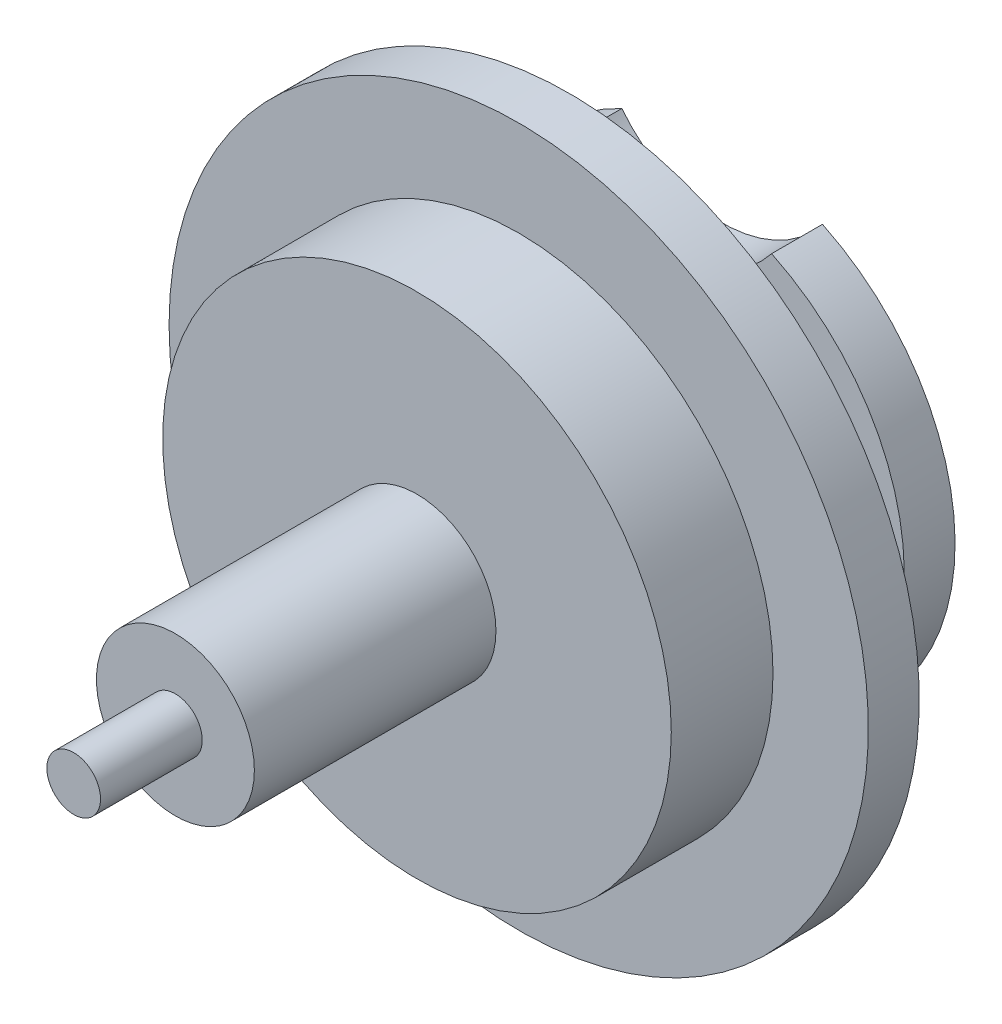
ISO-10303-21;
HEADER;
FILE_DESCRIPTION(('STEP AP214'),'2;1');
FILE_NAME('part.step','',(''),(''),'','','');
FILE_SCHEMA(('AUTOMOTIVE_DESIGN { 1 0 10303 214 1 1 1 1 }'));
ENDSEC;
DATA;
#1=APPLICATION_CONTEXT('core data for automotive mechanical design processes');
#2=APPLICATION_PROTOCOL_DEFINITION('international standard','automotive_design',2000,#1);
#3=PRODUCT_CONTEXT('',#1,'mechanical');
#4=PRODUCT('Part','Part','',(#3));
#5=PRODUCT_RELATED_PRODUCT_CATEGORY('part','',(#4));
#6=PRODUCT_DEFINITION_FORMATION('','',#4);
#7=PRODUCT_DEFINITION_CONTEXT('part definition',#1,'design');
#8=PRODUCT_DEFINITION('design','',#6,#7);
#9=PRODUCT_DEFINITION_SHAPE('','',#8);
#10=(LENGTH_UNIT() NAMED_UNIT(*) SI_UNIT(.MILLI.,.METRE.));
#11=(NAMED_UNIT(*) PLANE_ANGLE_UNIT() SI_UNIT($,.RADIAN.));
#12=(NAMED_UNIT(*) SI_UNIT($,.STERADIAN.) SOLID_ANGLE_UNIT());
#13=UNCERTAINTY_MEASURE_WITH_UNIT(LENGTH_MEASURE(1.E-05),#10,'distance_accuracy_value','');
#14=(GEOMETRIC_REPRESENTATION_CONTEXT(3) GLOBAL_UNCERTAINTY_ASSIGNED_CONTEXT((#13)) GLOBAL_UNIT_ASSIGNED_CONTEXT((#10,
#11,#12)) REPRESENTATION_CONTEXT('',''));
#15=CARTESIAN_POINT('',(0.,0.,0.));
#16=DIRECTION('',(0.,0.,1.));
#17=DIRECTION('',(1.,0.,0.));
#18=AXIS2_PLACEMENT_3D('',#15,#16,#17);
#19=CARTESIAN_POINT('',(0.,0.,-0.4));
#20=DIRECTION('',(0.,0.,1.));
#21=DIRECTION('',(1.,0.,0.));
#22=AXIS2_PLACEMENT_3D('',#19,#20,#21);
#23=CYLINDRICAL_SURFACE('',#22,1.);
#24=CARTESIAN_POINT('',(0.,0.,-0.4));
#25=DIRECTION('',(0.,0.,-1.));
#26=DIRECTION('',(-1.,0.,0.));
#27=AXIS2_PLACEMENT_3D('',#24,#25,#26);
#28=CIRCLE('',#27,1.);
#29=CARTESIAN_POINT('',(-1.,0.,-0.4));
#30=VERTEX_POINT('',#29);
#31=EDGE_CURVE('E86',#30,#30,#28,.F.);
#32=ORIENTED_EDGE('',*,*,#31,.T.);
#33=EDGE_LOOP('',(#32));
#34=FACE_BOUND('',#33,.T.);
#35=CARTESIAN_POINT('',(0.,0.,0.));
#36=DIRECTION('',(0.,0.,1.));
#37=DIRECTION('',(1.,0.,0.));
#38=AXIS2_PLACEMENT_3D('',#35,#36,#37);
#39=CIRCLE('',#38,1.);
#40=CARTESIAN_POINT('',(1.,0.,0.));
#41=VERTEX_POINT('',#40);
#42=EDGE_CURVE('E93',#41,#41,#39,.T.);
#43=ORIENTED_EDGE('',*,*,#42,.F.);
#44=EDGE_LOOP('',(#43));
#45=FACE_BOUND('',#44,.T.);
#46=ADVANCED_FACE('F37',(#34,#45),#23,.T.);
#47=CARTESIAN_POINT('',(0.,0.,0.));
#48=DIRECTION('',(0.,0.,1.));
#49=DIRECTION('',(1.,0.,0.));
#50=AXIS2_PLACEMENT_3D('',#47,#48,#49);
#51=PLANE('',#50);
#52=CARTESIAN_POINT('',(0.,0.,0.));
#53=DIRECTION('',(0.,0.,1.));
#54=DIRECTION('',(1.,0.,0.));
#55=AXIS2_PLACEMENT_3D('',#52,#53,#54);
#56=CIRCLE('',#55,0.3105);
#57=CARTESIAN_POINT('',(0.3105,0.,0.));
#58=VERTEX_POINT('',#57);
#59=EDGE_CURVE('E96',#58,#58,#56,.T.);
#60=ORIENTED_EDGE('',*,*,#59,.F.);
#61=EDGE_LOOP('',(#60));
#62=FACE_BOUND('',#61,.T.);
#63=ORIENTED_EDGE('',*,*,#42,.T.);
#64=EDGE_LOOP('',(#63));
#65=FACE_BOUND('',#64,.T.);
#66=ADVANCED_FACE('F137',(#62,#65),#51,.T.);
#67=CARTESIAN_POINT('',(0.,0.,1.35));
#68=DIRECTION('',(0.,0.,1.));
#69=DIRECTION('',(1.,0.,0.));
#70=AXIS2_PLACEMENT_3D('',#67,#68,#69);
#71=PLANE('',#70);
#72=CARTESIAN_POINT('',(0.,0.,1.35));
#73=DIRECTION('',(0.,0.,1.));
#74=DIRECTION('',(1.,0.,0.));
#75=AXIS2_PLACEMENT_3D('',#72,#73,#74);
#76=CIRCLE('',#75,0.1055);
#77=CARTESIAN_POINT('',(0.1055,0.,1.35));
#78=VERTEX_POINT('',#77);
#79=EDGE_CURVE('E101',#78,#78,#76,.T.);
#80=ORIENTED_EDGE('',*,*,#79,.T.);
#81=EDGE_LOOP('',(#80));
#82=FACE_BOUND('',#81,.T.);
#83=ADVANCED_FACE('F143',(#82),#71,.T.);
#84=CARTESIAN_POINT('',(0.,0.,2.04839906166072));
#85=DIRECTION('',(0.,0.,-1.));
#86=DIRECTION('',(-1.,0.,0.));
#87=AXIS2_PLACEMENT_3D('',#84,#85,#86);
#88=CYLINDRICAL_SURFACE('',#87,0.1055);
#89=CARTESIAN_POINT('',(0.,0.,0.95));
#90=DIRECTION('',(0.,0.,1.));
#91=DIRECTION('',(1.,0.,0.));
#92=AXIS2_PLACEMENT_3D('',#89,#90,#91);
#93=CIRCLE('',#92,0.1055);
#94=CARTESIAN_POINT('',(0.1055,0.,0.95));
#95=VERTEX_POINT('',#94);
#96=EDGE_CURVE('E104',#95,#95,#93,.F.);
#97=ORIENTED_EDGE('',*,*,#96,.F.);
#98=EDGE_LOOP('',(#97));
#99=FACE_BOUND('',#98,.T.);
#100=ORIENTED_EDGE('',*,*,#79,.F.);
#101=EDGE_LOOP('',(#100));
#102=FACE_BOUND('',#101,.T.);
#103=ADVANCED_FACE('F153',(#99,#102),#88,.T.);
#104=CARTESIAN_POINT('',(0.,0.,0.95));
#105=DIRECTION('',(0.,0.,1.));
#106=DIRECTION('',(1.,0.,0.));
#107=AXIS2_PLACEMENT_3D('',#104,#105,#106);
#108=PLANE('',#107);
#109=ORIENTED_EDGE('',*,*,#96,.T.);
#110=EDGE_LOOP('',(#109));
#111=FACE_BOUND('',#110,.T.);
#112=CARTESIAN_POINT('',(0.,0.,0.95));
#113=DIRECTION('',(0.,0.,1.));
#114=DIRECTION('',(1.,0.,0.));
#115=AXIS2_PLACEMENT_3D('',#112,#113,#114);
#116=CIRCLE('',#115,0.3105);
#117=CARTESIAN_POINT('',(0.3105,0.,0.95));
#118=VERTEX_POINT('',#117);
#119=EDGE_CURVE('E45',#118,#118,#116,.T.);
#120=ORIENTED_EDGE('',*,*,#119,.T.);
#121=EDGE_LOOP('',(#120));
#122=FACE_BOUND('',#121,.T.);
#123=ADVANCED_FACE('F156',(#111,#122),#108,.T.);
#124=CARTESIAN_POINT('',(0.,0.,0.95));
#125=DIRECTION('',(0.,0.,-1.));
#126=DIRECTION('',(-1.,0.,0.));
#127=AXIS2_PLACEMENT_3D('',#124,#125,#126);
#128=CYLINDRICAL_SURFACE('',#127,0.3105);
#129=ORIENTED_EDGE('',*,*,#59,.T.);
#130=EDGE_LOOP('',(#129));
#131=FACE_BOUND('',#130,.T.);
#132=ORIENTED_EDGE('',*,*,#119,.F.);
#133=EDGE_LOOP('',(#132));
#134=FACE_BOUND('',#133,.T.);
#135=ADVANCED_FACE('F39',(#131,#134),#128,.T.);
#136=CARTESIAN_POINT('',(0.,0.,-0.6));
#137=DIRECTION('',(0.,0.,1.));
#138=DIRECTION('',(1.,0.,0.));
#139=AXIS2_PLACEMENT_3D('',#136,#137,#138);
#140=CYLINDRICAL_SURFACE('',#139,1.375);
#141=CARTESIAN_POINT('',(0.,0.,-0.6));
#142=DIRECTION('',(0.,0.,-1.));
#143=DIRECTION('',(-1.,0.,0.));
#144=AXIS2_PLACEMENT_3D('',#141,#142,#143);
#145=CIRCLE('',#144,1.375);
#146=CARTESIAN_POINT('',(-1.375,0.,-0.6));
#147=VERTEX_POINT('',#146);
#148=EDGE_CURVE('E83',#147,#147,#145,.T.);
#149=ORIENTED_EDGE('',*,*,#148,.F.);
#150=EDGE_LOOP('',(#149));
#151=FACE_BOUND('',#150,.T.);
#152=CARTESIAN_POINT('',(0.,0.,-0.4));
#153=DIRECTION('',(0.,0.,-1.));
#154=DIRECTION('',(-1.,0.,0.));
#155=AXIS2_PLACEMENT_3D('',#152,#153,#154);
#156=CIRCLE('',#155,1.375);
#157=CARTESIAN_POINT('',(-1.375,0.,-0.4));
#158=VERTEX_POINT('',#157);
#159=EDGE_CURVE('E87',#158,#158,#156,.T.);
#160=ORIENTED_EDGE('',*,*,#159,.T.);
#161=EDGE_LOOP('',(#160));
#162=FACE_BOUND('',#161,.T.);
#163=ADVANCED_FACE('F169',(#151,#162),#140,.T.);
#164=CARTESIAN_POINT('',(0.,0.,-0.6));
#165=DIRECTION('',(0.,0.,-1.));
#166=DIRECTION('',(-1.,0.,0.));
#167=AXIS2_PLACEMENT_3D('',#164,#165,#166);
#168=PLANE('',#167);
#169=CARTESIAN_POINT('',(0.,1.04366641613751,-0.6));
#170=DIRECTION('',(0.,0.,-1.));
#171=DIRECTION('',(-0.999999080588237,0.00135603196133339,0.));
#172=AXIS2_PLACEMENT_3D('',#169,#170,#171);
#173=ELLIPSE('',#172,0.246000000000004,0.0779999999999952);
#174=CARTESIAN_POINT('',(-0.245999773824706,1.044,-0.6));
#175=VERTEX_POINT('',#174);
#176=EDGE_CURVE('E206',#175,#175,#173,.T.);
#177=ORIENTED_EDGE('',*,*,#176,.F.);
#178=EDGE_LOOP('',(#177));
#179=FACE_BOUND('',#178,.T.);
#180=CARTESIAN_POINT('',(0.,0.,-0.6));
#181=DIRECTION('',(0.,0.,-1.));
#182=DIRECTION('',(-1.,0.,0.));
#183=AXIS2_PLACEMENT_3D('',#180,#181,#182);
#184=CIRCLE('',#183,0.3105);
#185=CARTESIAN_POINT('',(-0.3105,0.,-0.6));
#186=VERTEX_POINT('',#185);
#187=EDGE_CURVE('E92',#186,#186,#184,.T.);
#188=ORIENTED_EDGE('',*,*,#187,.F.);
#189=EDGE_LOOP('',(#188));
#190=FACE_BOUND('',#189,.T.);
#191=ORIENTED_EDGE('',*,*,#148,.T.);
#192=EDGE_LOOP('',(#191));
#193=FACE_BOUND('',#192,.T.);
#194=ADVANCED_FACE('F180',(#179,#190,#193),#168,.T.);
#195=CARTESIAN_POINT('',(0.,0.,-0.4));
#196=DIRECTION('',(0.,0.,-1.));
#197=DIRECTION('',(-1.,0.,0.));
#198=AXIS2_PLACEMENT_3D('',#195,#196,#197);
#199=PLANE('',#198);
#200=ORIENTED_EDGE('',*,*,#31,.F.);
#201=EDGE_LOOP('',(#200));
#202=FACE_BOUND('',#201,.T.);
#203=ORIENTED_EDGE('',*,*,#159,.F.);
#204=EDGE_LOOP('',(#203));
#205=FACE_BOUND('',#204,.T.);
#206=ADVANCED_FACE('F185',(#202,#205),#199,.F.);
#207=CARTESIAN_POINT('',(0.,0.,-1.));
#208=DIRECTION('',(0.,0.,1.));
#209=DIRECTION('',(1.,0.,0.));
#210=AXIS2_PLACEMENT_3D('',#207,#208,#209);
#211=CIRCLE('',#210,0.3105);
#212=CARTESIAN_POINT('',(0.3105,0.,-1.));
#213=VERTEX_POINT('',#212);
#214=EDGE_CURVE('E79',#213,#213,#211,.T.);
#215=ORIENTED_EDGE('',*,*,#214,.T.);
#216=EDGE_LOOP('',(#215));
#217=FACE_BOUND('',#216,.T.);
#218=ORIENTED_EDGE('',*,*,#187,.T.);
#219=EDGE_LOOP('',(#218));
#220=FACE_BOUND('',#219,.T.);
#221=ADVANCED_FACE('F120',(#217,#220),#128,.T.);
#222=CARTESIAN_POINT('',(0.,0.,-1.2));
#223=DIRECTION('',(0.,0.,1.));
#224=DIRECTION('',(1.,0.,0.));
#225=AXIS2_PLACEMENT_3D('',#222,#223,#224);
#226=CYLINDRICAL_SURFACE('',#225,0.916);
#227=DIRECTION('',(0.,0.,-1.));
#228=VECTOR('',#227,1.);
#229=CARTESIAN_POINT('',(-0.394438833135507,0.826724867724868,-1.1));
#230=LINE('',#229,#228);
#231=CARTESIAN_POINT('',(-0.394438833135507,0.826724867724868,-1.2));
#232=VERTEX_POINT('',#231);
#233=CARTESIAN_POINT('',(-0.394438833135507,0.826724867724868,-1.));
#234=VERTEX_POINT('',#233);
#235=EDGE_CURVE('E52',#232,#234,#230,.F.);
#236=ORIENTED_EDGE('',*,*,#235,.F.);
#237=CARTESIAN_POINT('',(0.,0.,-1.2));
#238=DIRECTION('',(0.,0.,1.));
#239=DIRECTION('',(1.,0.,0.));
#240=AXIS2_PLACEMENT_3D('',#237,#238,#239);
#241=CIRCLE('',#240,0.916);
#242=CARTESIAN_POINT('',(0.394438833135507,0.826724867724868,-1.2));
#243=VERTEX_POINT('',#242);
#244=EDGE_CURVE('E74',#232,#243,#241,.T.);
#245=ORIENTED_EDGE('',*,*,#244,.T.);
#246=DIRECTION('',(0.,0.,-1.));
#247=VECTOR('',#246,1.);
#248=CARTESIAN_POINT('',(0.394438833135507,0.826724867724868,-1.1));
#249=LINE('',#248,#247);
#250=CARTESIAN_POINT('',(0.394438833135507,0.826724867724868,-1.));
#251=VERTEX_POINT('',#250);
#252=EDGE_CURVE('E64',#251,#243,#249,.T.);
#253=ORIENTED_EDGE('',*,*,#252,.F.);
#254=CARTESIAN_POINT('',(0.,0.,-1.));
#255=DIRECTION('',(0.,0.,1.));
#256=DIRECTION('',(1.,0.,0.));
#257=AXIS2_PLACEMENT_3D('',#254,#255,#256);
#258=CIRCLE('',#257,0.916);
#259=EDGE_CURVE('E72',#234,#251,#258,.T.);
#260=ORIENTED_EDGE('',*,*,#259,.F.);
#261=EDGE_LOOP('',(#236,#245,#253,#260));
#262=FACE_BOUND('',#261,.T.);
#263=ADVANCED_FACE('F71',(#262),#226,.T.);
#264=CARTESIAN_POINT('',(0.,0.,-1.2));
#265=DIRECTION('',(0.,0.,1.));
#266=DIRECTION('',(1.,0.,0.));
#267=AXIS2_PLACEMENT_3D('',#264,#265,#266);
#268=PLANE('',#267);
#269=CARTESIAN_POINT('',(0.,0.,-1.2));
#270=DIRECTION('',(0.,0.,1.));
#271=DIRECTION('',(1.,0.,0.));
#272=AXIS2_PLACEMENT_3D('',#269,#270,#271);
#273=CIRCLE('',#272,0.3105);
#274=CARTESIAN_POINT('',(0.3105,0.,-1.2));
#275=VERTEX_POINT('',#274);
#276=EDGE_CURVE('E12',#275,#275,#273,.T.);
#277=ORIENTED_EDGE('',*,*,#276,.T.);
#278=EDGE_LOOP('',(#277));
#279=FACE_BOUND('',#278,.T.);
#280=ORIENTED_EDGE('',*,*,#244,.F.);
#281=CARTESIAN_POINT('',(0.,1.134,-1.2));
#282=DIRECTION('',(0.,0.,-1.));
#283=DIRECTION('',(-1.,0.,0.));
#284=AXIS2_PLACEMENT_3D('',#281,#282,#283);
#285=CIRCLE('',#284,0.5);
#286=EDGE_CURVE('E57',#243,#232,#285,.T.);
#287=ORIENTED_EDGE('',*,*,#286,.F.);
#288=EDGE_LOOP('',(#280,#287));
#289=FACE_BOUND('',#288,.T.);
#290=ADVANCED_FACE('F124',(#279,#289),#268,.F.);
#291=CARTESIAN_POINT('',(0.,0.,-1.));
#292=DIRECTION('',(0.,0.,1.));
#293=DIRECTION('',(1.,0.,0.));
#294=AXIS2_PLACEMENT_3D('',#291,#292,#293);
#295=PLANE('',#294);
#296=CARTESIAN_POINT('',(0.,1.134,-1.));
#297=DIRECTION('',(0.,0.,-1.));
#298=DIRECTION('',(-1.,0.,0.));
#299=AXIS2_PLACEMENT_3D('',#296,#297,#298);
#300=CIRCLE('',#299,0.5);
#301=EDGE_CURVE('E61',#251,#234,#300,.T.);
#302=ORIENTED_EDGE('',*,*,#301,.T.);
#303=ORIENTED_EDGE('',*,*,#259,.T.);
#304=EDGE_LOOP('',(#302,#303));
#305=FACE_BOUND('',#304,.T.);
#306=ORIENTED_EDGE('',*,*,#214,.F.);
#307=EDGE_LOOP('',(#306));
#308=FACE_BOUND('',#307,.T.);
#309=ADVANCED_FACE('F76',(#305,#308),#295,.T.);
#310=CARTESIAN_POINT('',(0.,0.,-1.75));
#311=DIRECTION('',(0.,0.,1.));
#312=DIRECTION('',(1.,0.,0.));
#313=AXIS2_PLACEMENT_3D('',#310,#311,#312);
#314=PLANE('',#313);
#315=CARTESIAN_POINT('',(0.,0.,-1.75));
#316=DIRECTION('',(0.,0.,1.));
#317=DIRECTION('',(1.,0.,0.));
#318=AXIS2_PLACEMENT_3D('',#315,#316,#317);
#319=CIRCLE('',#318,0.1055);
#320=CARTESIAN_POINT('',(0.1055,0.,-1.75));
#321=VERTEX_POINT('',#320);
#322=EDGE_CURVE('E97',#321,#321,#319,.F.);
#323=ORIENTED_EDGE('',*,*,#322,.T.);
#324=EDGE_LOOP('',(#323));
#325=FACE_BOUND('',#324,.T.);
#326=ADVANCED_FACE('F123',(#325),#314,.F.);
#327=CARTESIAN_POINT('',(0.,0.,-2.44839906166072));
#328=DIRECTION('',(0.,0.,1.));
#329=DIRECTION('',(1.,0.,0.));
#330=AXIS2_PLACEMENT_3D('',#327,#328,#329);
#331=CYLINDRICAL_SURFACE('',#330,0.1055);
#332=ORIENTED_EDGE('',*,*,#322,.F.);
#333=EDGE_LOOP('',(#332));
#334=FACE_BOUND('',#333,.T.);
#335=CARTESIAN_POINT('',(0.,0.,-1.35));
#336=DIRECTION('',(0.,0.,1.));
#337=DIRECTION('',(1.,0.,0.));
#338=AXIS2_PLACEMENT_3D('',#335,#336,#337);
#339=CIRCLE('',#338,0.1055);
#340=CARTESIAN_POINT('',(0.1055,0.,-1.35));
#341=VERTEX_POINT('',#340);
#342=EDGE_CURVE('E100',#341,#341,#339,.T.);
#343=ORIENTED_EDGE('',*,*,#342,.F.);
#344=EDGE_LOOP('',(#343));
#345=FACE_BOUND('',#344,.T.);
#346=ADVANCED_FACE('F130',(#334,#345),#331,.T.);
#347=CARTESIAN_POINT('',(0.,0.,-1.35));
#348=DIRECTION('',(0.,0.,1.));
#349=DIRECTION('',(1.,0.,0.));
#350=AXIS2_PLACEMENT_3D('',#347,#348,#349);
#351=PLANE('',#350);
#352=ORIENTED_EDGE('',*,*,#342,.T.);
#353=EDGE_LOOP('',(#352));
#354=FACE_BOUND('',#353,.T.);
#355=CARTESIAN_POINT('',(0.,0.,-1.35));
#356=DIRECTION('',(0.,0.,1.));
#357=DIRECTION('',(1.,0.,0.));
#358=AXIS2_PLACEMENT_3D('',#355,#356,#357);
#359=CIRCLE('',#358,0.3105);
#360=CARTESIAN_POINT('',(0.3105,0.,-1.35));
#361=VERTEX_POINT('',#360);
#362=EDGE_CURVE('E105',#361,#361,#359,.T.);
#363=ORIENTED_EDGE('',*,*,#362,.F.);
#364=EDGE_LOOP('',(#363));
#365=FACE_BOUND('',#364,.T.);
#366=ADVANCED_FACE('F151',(#354,#365),#351,.F.);
#367=ORIENTED_EDGE('',*,*,#362,.T.);
#368=EDGE_LOOP('',(#367));
#369=FACE_BOUND('',#368,.T.);
#370=ORIENTED_EDGE('',*,*,#276,.F.);
#371=EDGE_LOOP('',(#370));
#372=FACE_BOUND('',#371,.T.);
#373=ADVANCED_FACE('F162',(#369,#372),#128,.T.);
#374=CARTESIAN_POINT('',(0.,1.134,-1.));
#375=DIRECTION('',(0.,0.,-1.));
#376=DIRECTION('',(-1.,0.,0.));
#377=AXIS2_PLACEMENT_3D('',#374,#375,#376);
#378=CYLINDRICAL_SURFACE('',#377,0.5);
#379=ORIENTED_EDGE('',*,*,#235,.T.);
#380=ORIENTED_EDGE('',*,*,#301,.F.);
#381=ORIENTED_EDGE('',*,*,#252,.T.);
#382=ORIENTED_EDGE('',*,*,#286,.T.);
#383=EDGE_LOOP('',(#379,#380,#381,#382));
#384=FACE_BOUND('',#383,.T.);
#385=ADVANCED_FACE('F63',(#384),#378,.F.);
#386=CARTESIAN_POINT('',(0.,1.04366641613751,-0.45));
#387=DIRECTION('',(0.,0.,-1.));
#388=DIRECTION('',(-0.999999080588237,0.00135603196133339,0.));
#389=AXIS2_PLACEMENT_3D('',#386,#387,#388);
#390=ELLIPSE('',#389,0.246000000000004,0.0779999999999952);
#391=DIRECTION('',(0.,0.,-1.));
#392=VECTOR('',#391,1.);
#393=SURFACE_OF_LINEAR_EXTRUSION('',#390,#392);
#394=CARTESIAN_POINT('',(-0.245999773824706,1.044,-0.45));
#395=VERTEX_POINT('',#394);
#396=EDGE_CURVE('E211',#395,#395,#390,.T.);
#397=ORIENTED_EDGE('',*,*,#396,.F.);
#398=EDGE_LOOP('',(#397));
#399=FACE_BOUND('',#398,.T.);
#400=ORIENTED_EDGE('',*,*,#176,.T.);
#401=EDGE_LOOP('',(#400));
#402=FACE_BOUND('',#401,.T.);
#403=ADVANCED_FACE('F218',(#399,#402),#393,.F.);
#404=CARTESIAN_POINT('',(0.,1.04366641613751,-0.45));
#405=DIRECTION('',(0.,0.,-1.));
#406=DIRECTION('',(-1.,0.,0.));
#407=AXIS2_PLACEMENT_3D('',#404,#405,#406);
#408=PLANE('',#407);
#409=ORIENTED_EDGE('',*,*,#396,.T.);
#410=EDGE_LOOP('',(#409));
#411=FACE_BOUND('',#410,.T.);
#412=ADVANCED_FACE('F222',(#411),#408,.T.);
#413=CLOSED_SHELL('',(#46,#66,#83,#103,#123,#135,#163,#194,#206,#221,#263,#290,#309,#326,#346,
#366,#373,#385,#403,#412));
#414=MANIFOLD_SOLID_BREP('B2',#413);
#415=ADVANCED_BREP_SHAPE_REPRESENTATION('',(#18,#414),#14);
#416=SHAPE_DEFINITION_REPRESENTATION(#9,#415);
ENDSEC;
END-ISO-10303-21;
